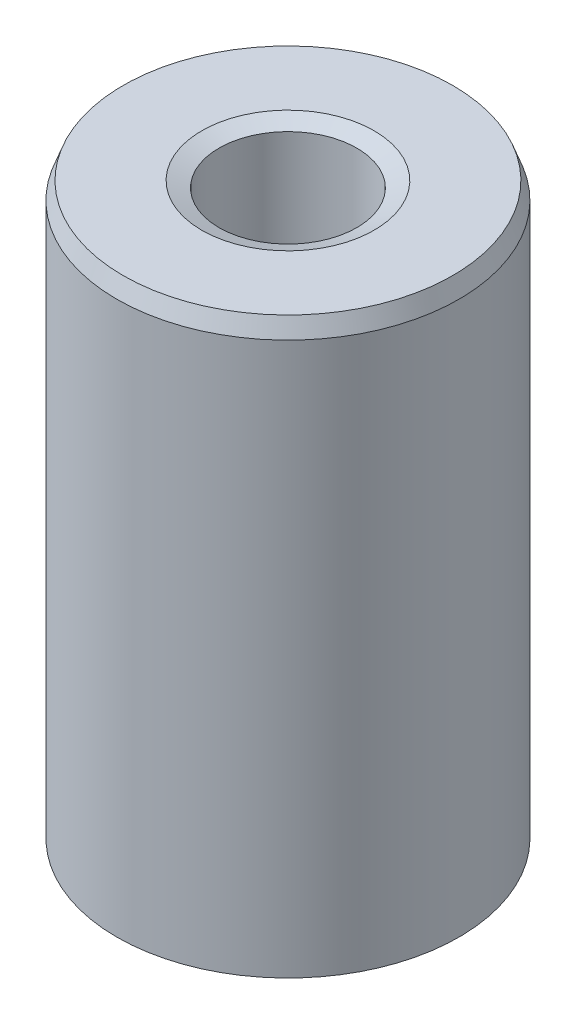
ISO-10303-21;
HEADER;
FILE_DESCRIPTION(('STEP AP214'),'2;1');
FILE_NAME('part.step','',(''),(''),'','','');
FILE_SCHEMA(('AUTOMOTIVE_DESIGN { 1 0 10303 214 1 1 1 1 }'));
ENDSEC;
DATA;
#1=APPLICATION_CONTEXT('core data for automotive mechanical design processes');
#2=APPLICATION_PROTOCOL_DEFINITION('international standard','automotive_design',2000,#1);
#3=PRODUCT_CONTEXT('',#1,'mechanical');
#4=PRODUCT('Part','Part','',(#3));
#5=PRODUCT_RELATED_PRODUCT_CATEGORY('part','',(#4));
#6=PRODUCT_DEFINITION_FORMATION('','',#4);
#7=PRODUCT_DEFINITION_CONTEXT('part definition',#1,'design');
#8=PRODUCT_DEFINITION('design','',#6,#7);
#9=PRODUCT_DEFINITION_SHAPE('','',#8);
#10=(LENGTH_UNIT() NAMED_UNIT(*) SI_UNIT(.MILLI.,.METRE.));
#11=(NAMED_UNIT(*) PLANE_ANGLE_UNIT() SI_UNIT($,.RADIAN.));
#12=(NAMED_UNIT(*) SI_UNIT($,.STERADIAN.) SOLID_ANGLE_UNIT());
#13=UNCERTAINTY_MEASURE_WITH_UNIT(LENGTH_MEASURE(1.E-05),#10,'distance_accuracy_value','');
#14=(GEOMETRIC_REPRESENTATION_CONTEXT(3) GLOBAL_UNCERTAINTY_ASSIGNED_CONTEXT((#13)) GLOBAL_UNIT_ASSIGNED_CONTEXT((#10,
#11,#12)) REPRESENTATION_CONTEXT('',''));
#15=CARTESIAN_POINT('',(0.,0.,0.));
#16=DIRECTION('',(0.,0.,1.));
#17=DIRECTION('',(1.,0.,0.));
#18=AXIS2_PLACEMENT_3D('',#15,#16,#17);
#19=CARTESIAN_POINT('',(0.,84.1594414001579,0.));
#20=DIRECTION('',(0.,-1.,0.));
#21=DIRECTION('',(0.,0.,-1.));
#22=AXIS2_PLACEMENT_3D('',#19,#20,#21);
#23=CYLINDRICAL_SURFACE('',#22,25.);
#24=CARTESIAN_POINT('',(0.,0.931059133481738,0.));
#25=DIRECTION('',(0.,1.,0.));
#26=DIRECTION('',(0.,0.,1.));
#27=AXIS2_PLACEMENT_3D('',#24,#25,#26);
#28=CIRCLE('',#27,25.);
#29=CARTESIAN_POINT('',(0.,0.931059133481738,25.));
#30=VERTEX_POINT('',#29);
#31=EDGE_CURVE('E10',#30,#30,#28,.T.);
#32=ORIENTED_EDGE('',*,*,#31,.T.);
#33=EDGE_LOOP('',(#32));
#34=FACE_BOUND('',#33,.T.);
#35=CARTESIAN_POINT('',(0.,81.6352764910724,0.));
#36=DIRECTION('',(0.,1.,0.));
#37=DIRECTION('',(0.,0.,1.));
#38=AXIS2_PLACEMENT_3D('',#35,#36,#37);
#39=CIRCLE('',#38,25.);
#40=CARTESIAN_POINT('',(0.,81.6352764910724,25.));
#41=VERTEX_POINT('',#40);
#42=EDGE_CURVE('E50',#41,#41,#39,.F.);
#43=ORIENTED_EDGE('',*,*,#42,.T.);
#44=EDGE_LOOP('',(#43));
#45=FACE_BOUND('',#44,.T.);
#46=ADVANCED_FACE('F39',(#34,#45),#23,.T.);
#47=CARTESIAN_POINT('',(0.,84.1594414001579,0.));
#48=DIRECTION('',(0.,1.,0.));
#49=DIRECTION('',(0.,0.,1.));
#50=AXIS2_PLACEMENT_3D('',#47,#48,#49);
#51=PLANE('',#50);
#52=CARTESIAN_POINT('',(0.,84.1594414001579,0.));
#53=DIRECTION('',(0.,1.,0.));
#54=DIRECTION('',(0.,0.,1.));
#55=AXIS2_PLACEMENT_3D('',#52,#53,#54);
#56=CIRCLE('',#55,12.5933602335547);
#57=CARTESIAN_POINT('',(0.,84.1594414001579,12.5933602335547));
#58=VERTEX_POINT('',#57);
#59=EDGE_CURVE('E58',#58,#58,#56,.F.);
#60=ORIENTED_EDGE('',*,*,#59,.T.);
#61=EDGE_LOOP('',(#60));
#62=FACE_BOUND('',#61,.T.);
#63=CARTESIAN_POINT('',(0.,84.1594414001579,0.));
#64=DIRECTION('',(0.,1.,0.));
#65=DIRECTION('',(0.,0.,1.));
#66=AXIS2_PLACEMENT_3D('',#63,#64,#65);
#67=CIRCLE('',#66,24.0689408665182);
#68=CARTESIAN_POINT('',(0.,84.1594414001579,24.0689408665182));
#69=VERTEX_POINT('',#68);
#70=EDGE_CURVE('E61',#69,#69,#67,.T.);
#71=ORIENTED_EDGE('',*,*,#70,.T.);
#72=EDGE_LOOP('',(#71));
#73=FACE_BOUND('',#72,.T.);
#74=ADVANCED_FACE('F88',(#62,#73),#51,.T.);
#75=CARTESIAN_POINT('',(0.,0.,0.));
#76=DIRECTION('',(0.,1.,0.));
#77=DIRECTION('',(0.,0.,1.));
#78=AXIS2_PLACEMENT_3D('',#75,#76,#77);
#79=PLANE('',#78);
#80=CARTESIAN_POINT('',(0.,0.,0.));
#81=DIRECTION('',(0.,1.,0.));
#82=DIRECTION('',(0.,0.,1.));
#83=AXIS2_PLACEMENT_3D('',#80,#81,#82);
#84=CIRCLE('',#83,11.0002544579509);
#85=CARTESIAN_POINT('',(0.,0.,11.0002544579509));
#86=VERTEX_POINT('',#85);
#87=EDGE_CURVE('E51',#86,#86,#84,.T.);
#88=ORIENTED_EDGE('',*,*,#87,.T.);
#89=EDGE_LOOP('',(#88));
#90=FACE_BOUND('',#89,.T.);
#91=CARTESIAN_POINT('',(0.,0.,0.));
#92=DIRECTION('',(0.,1.,0.));
#93=DIRECTION('',(0.,0.,1.));
#94=AXIS2_PLACEMENT_3D('',#91,#92,#93);
#95=CIRCLE('',#94,22.4758350909145);
#96=CARTESIAN_POINT('',(0.,0.,22.4758350909145));
#97=VERTEX_POINT('',#96);
#98=EDGE_CURVE('E54',#97,#97,#95,.F.);
#99=ORIENTED_EDGE('',*,*,#98,.T.);
#100=EDGE_LOOP('',(#99));
#101=FACE_BOUND('',#100,.T.);
#102=ADVANCED_FACE('F83',(#90,#101),#79,.F.);
#103=CARTESIAN_POINT('',(0.,84.1594414001579,0.));
#104=DIRECTION('',(0.,-1.,0.));
#105=DIRECTION('',(0.,0.,-1.));
#106=AXIS2_PLACEMENT_3D('',#103,#104,#105);
#107=CYLINDRICAL_SURFACE('',#106,10.0691953244692);
#108=CARTESIAN_POINT('',(0.,83.2283822666762,0.));
#109=DIRECTION('',(0.,1.,0.));
#110=DIRECTION('',(0.,0.,1.));
#111=AXIS2_PLACEMENT_3D('',#108,#109,#110);
#112=CIRCLE('',#111,10.0691953244692);
#113=CARTESIAN_POINT('',(0.,83.2283822666762,10.0691953244692));
#114=VERTEX_POINT('',#113);
#115=EDGE_CURVE('E67',#114,#114,#112,.T.);
#116=ORIENTED_EDGE('',*,*,#115,.T.);
#117=EDGE_LOOP('',(#116));
#118=FACE_BOUND('',#117,.T.);
#119=CARTESIAN_POINT('',(0.,2.52416490908548,0.));
#120=DIRECTION('',(0.,1.,0.));
#121=DIRECTION('',(0.,0.,1.));
#122=AXIS2_PLACEMENT_3D('',#119,#120,#121);
#123=CIRCLE('',#122,10.0691953244692);
#124=CARTESIAN_POINT('',(0.,2.52416490908548,10.0691953244692));
#125=VERTEX_POINT('',#124);
#126=EDGE_CURVE('E69',#125,#125,#123,.F.);
#127=ORIENTED_EDGE('',*,*,#126,.T.);
#128=EDGE_LOOP('',(#127));
#129=FACE_BOUND('',#128,.T.);
#130=ADVANCED_FACE('F71',(#118,#129),#107,.F.);
#131=CARTESIAN_POINT('',(0.,83.2283822666762,0.));
#132=DIRECTION('',(0.,1.,0.));
#133=DIRECTION('',(0.,0.,1.));
#134=AXIS2_PLACEMENT_3D('',#131,#132,#133);
#135=CONICAL_SURFACE('',#134,10.0691953244692,1.21742101788554);
#136=ORIENTED_EDGE('',*,*,#59,.F.);
#137=EDGE_LOOP('',(#136));
#138=FACE_BOUND('',#137,.T.);
#139=ORIENTED_EDGE('',*,*,#115,.F.);
#140=EDGE_LOOP('',(#139));
#141=FACE_BOUND('',#140,.T.);
#142=ADVANCED_FACE('F77',(#138,#141),#135,.F.);
#143=CARTESIAN_POINT('',(0.,0.,0.));
#144=DIRECTION('',(0.,-1.,0.));
#145=DIRECTION('',(0.,0.,-1.));
#146=AXIS2_PLACEMENT_3D('',#143,#144,#145);
#147=CONICAL_SURFACE('',#146,11.0002544579509,0.353375308909358);
#148=ORIENTED_EDGE('',*,*,#126,.F.);
#149=EDGE_LOOP('',(#148));
#150=FACE_BOUND('',#149,.T.);
#151=ORIENTED_EDGE('',*,*,#87,.F.);
#152=EDGE_LOOP('',(#151));
#153=FACE_BOUND('',#152,.T.);
#154=ADVANCED_FACE('F73',(#150,#153),#147,.F.);
#155=CARTESIAN_POINT('',(0.,0.931059133481738,0.));
#156=DIRECTION('',(0.,1.,0.));
#157=DIRECTION('',(0.,0.,1.));
#158=AXIS2_PLACEMENT_3D('',#155,#156,#157);
#159=CONICAL_SURFACE('',#158,25.,1.21742101788554);
#160=ORIENTED_EDGE('',*,*,#98,.F.);
#161=EDGE_LOOP('',(#160));
#162=FACE_BOUND('',#161,.T.);
#163=ORIENTED_EDGE('',*,*,#31,.F.);
#164=EDGE_LOOP('',(#163));
#165=FACE_BOUND('',#164,.T.);
#166=ADVANCED_FACE('F76',(#162,#165),#159,.T.);
#167=CARTESIAN_POINT('',(0.,84.1594414001579,0.));
#168=DIRECTION('',(0.,-1.,0.));
#169=DIRECTION('',(0.,0.,-1.));
#170=AXIS2_PLACEMENT_3D('',#167,#168,#169);
#171=CONICAL_SURFACE('',#170,24.0689408665182,0.35337530890936);
#172=ORIENTED_EDGE('',*,*,#42,.F.);
#173=EDGE_LOOP('',(#172));
#174=FACE_BOUND('',#173,.T.);
#175=ORIENTED_EDGE('',*,*,#70,.F.);
#176=EDGE_LOOP('',(#175));
#177=FACE_BOUND('',#176,.T.);
#178=ADVANCED_FACE('F45',(#174,#177),#171,.T.);
#179=CLOSED_SHELL('',(#46,#74,#102,#130,#142,#154,#166,#178));
#180=MANIFOLD_SOLID_BREP('B2',#179);
#181=ADVANCED_BREP_SHAPE_REPRESENTATION('',(#18,#180),#14);
#182=SHAPE_DEFINITION_REPRESENTATION(#9,#181);
ENDSEC;
END-ISO-10303-21;
